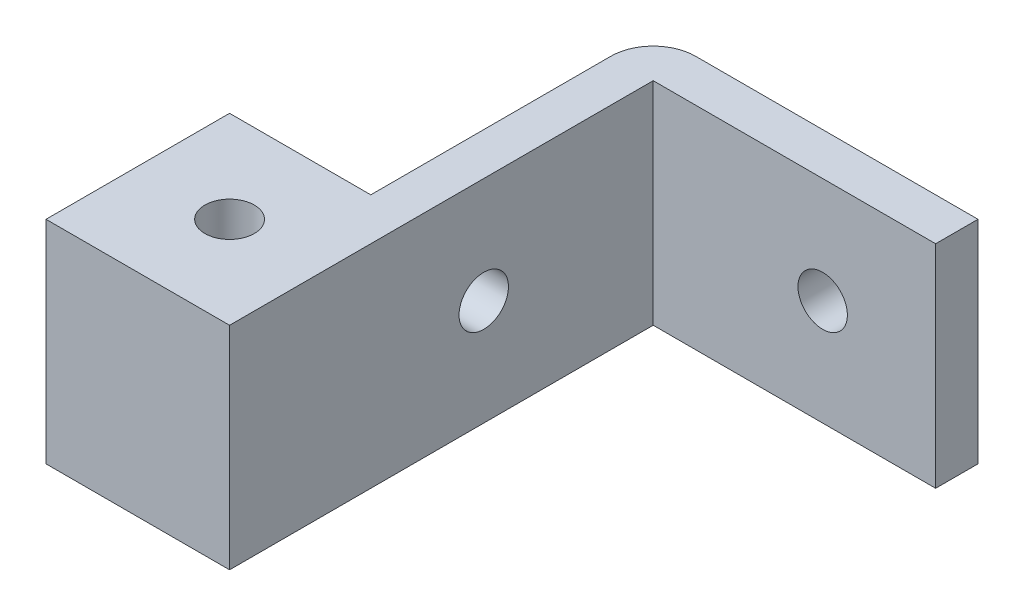
ISO-10303-21;
HEADER;
FILE_DESCRIPTION(('STEP AP214'),'2;1');
FILE_NAME('part.step','',(''),(''),'','','');
FILE_SCHEMA(('AUTOMOTIVE_DESIGN { 1 0 10303 214 1 1 1 1 }'));
ENDSEC;
DATA;
#1=APPLICATION_CONTEXT('core data for automotive mechanical design processes');
#2=APPLICATION_PROTOCOL_DEFINITION('international standard','automotive_design',2000,#1);
#3=PRODUCT_CONTEXT('',#1,'mechanical');
#4=PRODUCT('Part','Part','',(#3));
#5=PRODUCT_RELATED_PRODUCT_CATEGORY('part','',(#4));
#6=PRODUCT_DEFINITION_FORMATION('','',#4);
#7=PRODUCT_DEFINITION_CONTEXT('part definition',#1,'design');
#8=PRODUCT_DEFINITION('design','',#6,#7);
#9=PRODUCT_DEFINITION_SHAPE('','',#8);
#10=(LENGTH_UNIT() NAMED_UNIT(*) SI_UNIT(.MILLI.,.METRE.));
#11=(NAMED_UNIT(*) PLANE_ANGLE_UNIT() SI_UNIT($,.RADIAN.));
#12=(NAMED_UNIT(*) SI_UNIT($,.STERADIAN.) SOLID_ANGLE_UNIT());
#13=UNCERTAINTY_MEASURE_WITH_UNIT(LENGTH_MEASURE(1.E-05),#10,'distance_accuracy_value','');
#14=(GEOMETRIC_REPRESENTATION_CONTEXT(3) GLOBAL_UNCERTAINTY_ASSIGNED_CONTEXT((#13)) GLOBAL_UNIT_ASSIGNED_CONTEXT((#10,
#11,#12)) REPRESENTATION_CONTEXT('',''));
#15=CARTESIAN_POINT('',(0.,0.,0.));
#16=DIRECTION('',(0.,0.,1.));
#17=DIRECTION('',(1.,0.,0.));
#18=AXIS2_PLACEMENT_3D('',#15,#16,#17);
#19=CARTESIAN_POINT('',(-11.5,-7.5,3.));
#20=DIRECTION('',(1.,0.,0.));
#21=DIRECTION('',(0.,0.,-1.));
#22=AXIS2_PLACEMENT_3D('',#19,#20,#21);
#23=PLANE('',#22);
#24=CARTESIAN_POINT('',(-11.5,0.,15.));
#25=DIRECTION('',(-1.,0.,0.));
#26=DIRECTION('',(0.,0.,1.));
#27=AXIS2_PLACEMENT_3D('',#24,#25,#26);
#28=CIRCLE('',#27,1.75);
#29=CARTESIAN_POINT('',(-11.5,0.,16.75));
#30=VERTEX_POINT('',#29);
#31=EDGE_CURVE('E130',#30,#30,#28,.T.);
#32=ORIENTED_EDGE('',*,*,#31,.F.);
#33=EDGE_LOOP('',(#32));
#34=FACE_BOUND('',#33,.T.);
#35=DIRECTION('',(0.,-1.,0.));
#36=VECTOR('',#35,1.);
#37=CARTESIAN_POINT('',(-11.5,-7.5,20.));
#38=LINE('',#37,#36);
#39=CARTESIAN_POINT('',(-11.5,7.5,20.));
#40=VERTEX_POINT('',#39);
#41=CARTESIAN_POINT('',(-11.5,-7.5,20.));
#42=VERTEX_POINT('',#41);
#43=EDGE_CURVE('E145',#40,#42,#38,.T.);
#44=ORIENTED_EDGE('',*,*,#43,.F.);
#45=DIRECTION('',(0.,0.,-1.));
#46=VECTOR('',#45,1.);
#47=CARTESIAN_POINT('',(-11.5,7.5,3.));
#48=LINE('',#47,#46);
#49=CARTESIAN_POINT('',(-11.5,7.5,3.));
#50=VERTEX_POINT('',#49);
#51=EDGE_CURVE('E198',#40,#50,#48,.T.);
#52=ORIENTED_EDGE('',*,*,#51,.T.);
#53=DIRECTION('',(0.,-1.,0.));
#54=VECTOR('',#53,1.);
#55=CARTESIAN_POINT('',(-11.5,-7.5,3.));
#56=LINE('',#55,#54);
#57=CARTESIAN_POINT('',(-11.5,-7.5,3.));
#58=VERTEX_POINT('',#57);
#59=EDGE_CURVE('E203',#50,#58,#56,.T.);
#60=ORIENTED_EDGE('',*,*,#59,.T.);
#61=DIRECTION('',(0.,0.,-1.));
#62=VECTOR('',#61,1.);
#63=CARTESIAN_POINT('',(-11.5,-7.5,3.));
#64=LINE('',#63,#62);
#65=EDGE_CURVE('E196',#42,#58,#64,.T.);
#66=ORIENTED_EDGE('',*,*,#65,.F.);
#67=EDGE_LOOP('',(#44,#52,#60,#66));
#68=FACE_BOUND('',#67,.T.);
#69=ADVANCED_FACE('F49',(#34,#68),#23,.F.);
#70=CARTESIAN_POINT('',(0.,0.,3.));
#71=DIRECTION('',(0.,0.,-1.));
#72=DIRECTION('',(-1.,0.,0.));
#73=AXIS2_PLACEMENT_3D('',#70,#71,#72);
#74=PLANE('',#73);
#75=CARTESIAN_POINT('',(3.5,0.,3.));
#76=DIRECTION('',(0.,0.,-1.));
#77=DIRECTION('',(-1.,0.,0.));
#78=AXIS2_PLACEMENT_3D('',#75,#76,#77);
#79=CIRCLE('',#78,1.75);
#80=CARTESIAN_POINT('',(1.75,0.,3.));
#81=VERTEX_POINT('',#80);
#82=EDGE_CURVE('E168',#81,#81,#79,.T.);
#83=ORIENTED_EDGE('',*,*,#82,.T.);
#84=EDGE_LOOP('',(#83));
#85=FACE_BOUND('',#84,.T.);
#86=DIRECTION('',(0.,1.,0.));
#87=VECTOR('',#86,1.);
#88=CARTESIAN_POINT('',(-8.5,7.5,3.));
#89=LINE('',#88,#87);
#90=CARTESIAN_POINT('',(-8.5,-7.5,3.));
#91=VERTEX_POINT('',#90);
#92=CARTESIAN_POINT('',(-8.5,7.5,3.));
#93=VERTEX_POINT('',#92);
#94=EDGE_CURVE('E171',#91,#93,#89,.T.);
#95=ORIENTED_EDGE('',*,*,#94,.F.);
#96=DIRECTION('',(1.,0.,0.));
#97=VECTOR('',#96,1.);
#98=CARTESIAN_POINT('',(-11.5,-7.5,3.));
#99=LINE('',#98,#97);
#100=CARTESIAN_POINT('',(11.5,-7.5,3.));
#101=VERTEX_POINT('',#100);
#102=EDGE_CURVE('E186',#91,#101,#99,.T.);
#103=ORIENTED_EDGE('',*,*,#102,.T.);
#104=DIRECTION('',(0.,1.,0.));
#105=VECTOR('',#104,1.);
#106=CARTESIAN_POINT('',(11.5,-7.5,3.));
#107=LINE('',#106,#105);
#108=CARTESIAN_POINT('',(11.5,7.5,3.));
#109=VERTEX_POINT('',#108);
#110=EDGE_CURVE('E180',#101,#109,#107,.T.);
#111=ORIENTED_EDGE('',*,*,#110,.T.);
#112=DIRECTION('',(-1.,0.,0.));
#113=VECTOR('',#112,1.);
#114=CARTESIAN_POINT('',(-11.5,7.5,3.));
#115=LINE('',#114,#113);
#116=EDGE_CURVE('E183',#109,#93,#115,.T.);
#117=ORIENTED_EDGE('',*,*,#116,.T.);
#118=EDGE_LOOP('',(#95,#103,#111,#117));
#119=FACE_BOUND('',#118,.T.);
#120=ADVANCED_FACE('F226',(#85,#119),#74,.F.);
#121=CARTESIAN_POINT('',(11.5,-7.5,3.));
#122=DIRECTION('',(-1.,0.,0.));
#123=DIRECTION('',(0.,0.,1.));
#124=AXIS2_PLACEMENT_3D('',#121,#122,#123);
#125=PLANE('',#124);
#126=DIRECTION('',(0.,1.,0.));
#127=VECTOR('',#126,1.);
#128=CARTESIAN_POINT('',(11.5,-7.5,0.));
#129=LINE('',#128,#127);
#130=CARTESIAN_POINT('',(11.5,-7.5,0.));
#131=VERTEX_POINT('',#130);
#132=CARTESIAN_POINT('',(11.5,7.5,0.));
#133=VERTEX_POINT('',#132);
#134=EDGE_CURVE('E179',#131,#133,#129,.T.);
#135=ORIENTED_EDGE('',*,*,#134,.T.);
#136=DIRECTION('',(0.,0.,-1.));
#137=VECTOR('',#136,1.);
#138=CARTESIAN_POINT('',(11.5,7.5,3.));
#139=LINE('',#138,#137);
#140=EDGE_CURVE('E200',#109,#133,#139,.T.);
#141=ORIENTED_EDGE('',*,*,#140,.F.);
#142=ORIENTED_EDGE('',*,*,#110,.F.);
#143=DIRECTION('',(0.,0.,-1.));
#144=VECTOR('',#143,1.);
#145=CARTESIAN_POINT('',(11.5,-7.5,3.));
#146=LINE('',#145,#144);
#147=EDGE_CURVE('E188',#101,#131,#146,.T.);
#148=ORIENTED_EDGE('',*,*,#147,.T.);
#149=EDGE_LOOP('',(#135,#141,#142,#148));
#150=FACE_BOUND('',#149,.T.);
#151=ADVANCED_FACE('F218',(#150),#125,.F.);
#152=CARTESIAN_POINT('',(-11.5,7.5,3.));
#153=DIRECTION('',(0.,-1.,0.));
#154=DIRECTION('',(0.,0.,-1.));
#155=AXIS2_PLACEMENT_3D('',#152,#153,#154);
#156=PLANE('',#155);
#157=CARTESIAN_POINT('',(-15.,7.5,26.5));
#158=DIRECTION('',(0.,-1.,0.));
#159=DIRECTION('',(0.,0.,-1.));
#160=AXIS2_PLACEMENT_3D('',#157,#158,#159);
#161=CIRCLE('',#160,1.75);
#162=CARTESIAN_POINT('',(-15.,7.5,24.75));
#163=VERTEX_POINT('',#162);
#164=EDGE_CURVE('E147',#163,#163,#161,.T.);
#165=ORIENTED_EDGE('',*,*,#164,.T.);
#166=EDGE_LOOP('',(#165));
#167=FACE_BOUND('',#166,.T.);
#168=DIRECTION('',(-1.,0.,0.));
#169=VECTOR('',#168,1.);
#170=CARTESIAN_POINT('',(-11.5,7.5,0.));
#171=LINE('',#170,#169);
#172=CARTESIAN_POINT('',(-8.5,7.5,0.));
#173=VERTEX_POINT('',#172);
#174=EDGE_CURVE('E191',#133,#173,#171,.T.);
#175=ORIENTED_EDGE('',*,*,#174,.T.);
#176=CARTESIAN_POINT('',(-8.5,7.5,3.));
#177=DIRECTION('',(0.,-1.,0.));
#178=DIRECTION('',(0.,0.,-1.));
#179=AXIS2_PLACEMENT_3D('',#176,#177,#178);
#180=CIRCLE('',#179,3.);
#181=EDGE_CURVE('E13',#173,#50,#180,.F.);
#182=ORIENTED_EDGE('',*,*,#181,.T.);
#183=ORIENTED_EDGE('',*,*,#51,.F.);
#184=DIRECTION('',(1.,0.,0.));
#185=VECTOR('',#184,1.);
#186=CARTESIAN_POINT('',(-21.5,7.5,20.));
#187=LINE('',#186,#185);
#188=CARTESIAN_POINT('',(-21.5,7.5,20.));
#189=VERTEX_POINT('',#188);
#190=EDGE_CURVE('E136',#189,#40,#187,.T.);
#191=ORIENTED_EDGE('',*,*,#190,.F.);
#192=DIRECTION('',(0.,0.,-1.));
#193=VECTOR('',#192,1.);
#194=CARTESIAN_POINT('',(-21.5,7.5,33.));
#195=LINE('',#194,#193);
#196=CARTESIAN_POINT('',(-21.5,7.5,33.));
#197=VERTEX_POINT('',#196);
#198=EDGE_CURVE('E133',#197,#189,#195,.T.);
#199=ORIENTED_EDGE('',*,*,#198,.F.);
#200=DIRECTION('',(-1.,0.,0.));
#201=VECTOR('',#200,1.);
#202=CARTESIAN_POINT('',(-11.5,7.5,33.));
#203=LINE('',#202,#201);
#204=CARTESIAN_POINT('',(-8.5,7.5,33.));
#205=VERTEX_POINT('',#204);
#206=EDGE_CURVE('E120',#205,#197,#203,.T.);
#207=ORIENTED_EDGE('',*,*,#206,.F.);
#208=DIRECTION('',(0.,0.,-1.));
#209=VECTOR('',#208,1.);
#210=CARTESIAN_POINT('',(-8.5,7.5,23.));
#211=LINE('',#210,#209);
#212=EDGE_CURVE('E174',#205,#93,#211,.T.);
#213=ORIENTED_EDGE('',*,*,#212,.T.);
#214=ORIENTED_EDGE('',*,*,#116,.F.);
#215=ORIENTED_EDGE('',*,*,#140,.T.);
#216=EDGE_LOOP('',(#175,#182,#183,#191,#199,#207,#213,#214,#215));
#217=FACE_BOUND('',#216,.T.);
#218=ADVANCED_FACE('F134',(#167,#217),#156,.F.);
#219=CARTESIAN_POINT('',(-11.5,-7.5,3.));
#220=DIRECTION('',(0.,1.,0.));
#221=DIRECTION('',(0.,0.,1.));
#222=AXIS2_PLACEMENT_3D('',#219,#220,#221);
#223=PLANE('',#222);
#224=CARTESIAN_POINT('',(-15.,-7.5,26.5));
#225=DIRECTION('',(0.,-1.,0.));
#226=DIRECTION('',(0.,0.,-1.));
#227=AXIS2_PLACEMENT_3D('',#224,#225,#226);
#228=CIRCLE('',#227,1.75);
#229=CARTESIAN_POINT('',(-15.,-7.5,24.75));
#230=VERTEX_POINT('',#229);
#231=EDGE_CURVE('E150',#230,#230,#228,.T.);
#232=ORIENTED_EDGE('',*,*,#231,.F.);
#233=EDGE_LOOP('',(#232));
#234=FACE_BOUND('',#233,.T.);
#235=DIRECTION('',(1.,0.,0.));
#236=VECTOR('',#235,1.);
#237=CARTESIAN_POINT('',(-11.5,-7.5,33.));
#238=LINE('',#237,#236);
#239=CARTESIAN_POINT('',(-21.5,-7.5,33.));
#240=VERTEX_POINT('',#239);
#241=CARTESIAN_POINT('',(-8.5,-7.5,33.));
#242=VERTEX_POINT('',#241);
#243=EDGE_CURVE('E159',#240,#242,#238,.T.);
#244=ORIENTED_EDGE('',*,*,#243,.F.);
#245=DIRECTION('',(0.,0.,1.));
#246=VECTOR('',#245,1.);
#247=CARTESIAN_POINT('',(-21.5,-7.5,33.));
#248=LINE('',#247,#246);
#249=CARTESIAN_POINT('',(-21.5,-7.5,20.));
#250=VERTEX_POINT('',#249);
#251=EDGE_CURVE('E144',#250,#240,#248,.T.);
#252=ORIENTED_EDGE('',*,*,#251,.F.);
#253=DIRECTION('',(1.,0.,0.));
#254=VECTOR('',#253,1.);
#255=CARTESIAN_POINT('',(-21.5,-7.5,20.));
#256=LINE('',#255,#254);
#257=EDGE_CURVE('E154',#250,#42,#256,.T.);
#258=ORIENTED_EDGE('',*,*,#257,.T.);
#259=ORIENTED_EDGE('',*,*,#65,.T.);
#260=CARTESIAN_POINT('',(-8.5,-7.5,3.));
#261=DIRECTION('',(0.,1.,0.));
#262=DIRECTION('',(0.,0.,1.));
#263=AXIS2_PLACEMENT_3D('',#260,#261,#262);
#264=CIRCLE('',#263,3.);
#265=CARTESIAN_POINT('',(-8.5,-7.5,0.));
#266=VERTEX_POINT('',#265);
#267=EDGE_CURVE('E71',#58,#266,#264,.F.);
#268=ORIENTED_EDGE('',*,*,#267,.T.);
#269=DIRECTION('',(1.,0.,0.));
#270=VECTOR('',#269,1.);
#271=CARTESIAN_POINT('',(-11.5,-7.5,0.));
#272=LINE('',#271,#270);
#273=EDGE_CURVE('E184',#266,#131,#272,.T.);
#274=ORIENTED_EDGE('',*,*,#273,.T.);
#275=ORIENTED_EDGE('',*,*,#147,.F.);
#276=ORIENTED_EDGE('',*,*,#102,.F.);
#277=DIRECTION('',(0.,0.,-1.));
#278=VECTOR('',#277,1.);
#279=CARTESIAN_POINT('',(-8.5,-7.5,23.));
#280=LINE('',#279,#278);
#281=EDGE_CURVE('E176',#242,#91,#280,.T.);
#282=ORIENTED_EDGE('',*,*,#281,.F.);
#283=EDGE_LOOP('',(#244,#252,#258,#259,#268,#274,#275,#276,#282));
#284=FACE_BOUND('',#283,.T.);
#285=ADVANCED_FACE('F222',(#234,#284),#223,.F.);
#286=CARTESIAN_POINT('',(0.,0.,0.));
#287=DIRECTION('',(0.,0.,-1.));
#288=DIRECTION('',(-1.,0.,0.));
#289=AXIS2_PLACEMENT_3D('',#286,#287,#288);
#290=PLANE('',#289);
#291=CARTESIAN_POINT('',(3.5,0.,0.));
#292=DIRECTION('',(0.,0.,-1.));
#293=DIRECTION('',(-1.,0.,0.));
#294=AXIS2_PLACEMENT_3D('',#291,#292,#293);
#295=CIRCLE('',#294,1.75);
#296=CARTESIAN_POINT('',(1.75,0.,0.));
#297=VERTEX_POINT('',#296);
#298=EDGE_CURVE('E165',#297,#297,#295,.T.);
#299=ORIENTED_EDGE('',*,*,#298,.F.);
#300=EDGE_LOOP('',(#299));
#301=FACE_BOUND('',#300,.T.);
#302=ORIENTED_EDGE('',*,*,#273,.F.);
#303=DIRECTION('',(0.,-1.,0.));
#304=VECTOR('',#303,1.);
#305=CARTESIAN_POINT('',(-8.5,7.5,0.));
#306=LINE('',#305,#304);
#307=EDGE_CURVE('E57',#266,#173,#306,.F.);
#308=ORIENTED_EDGE('',*,*,#307,.T.);
#309=ORIENTED_EDGE('',*,*,#174,.F.);
#310=ORIENTED_EDGE('',*,*,#134,.F.);
#311=EDGE_LOOP('',(#302,#308,#309,#310));
#312=FACE_BOUND('',#311,.T.);
#313=ADVANCED_FACE('F216',(#301,#312),#290,.T.);
#314=CARTESIAN_POINT('',(-8.5,7.5,23.));
#315=DIRECTION('',(-1.,0.,0.));
#316=DIRECTION('',(0.,0.,1.));
#317=AXIS2_PLACEMENT_3D('',#314,#315,#316);
#318=PLANE('',#317);
#319=CARTESIAN_POINT('',(-8.5,0.,15.));
#320=DIRECTION('',(-1.,0.,0.));
#321=DIRECTION('',(0.,0.,1.));
#322=AXIS2_PLACEMENT_3D('',#319,#320,#321);
#323=CIRCLE('',#322,1.75);
#324=CARTESIAN_POINT('',(-8.5,0.,16.75));
#325=VERTEX_POINT('',#324);
#326=EDGE_CURVE('E164',#325,#325,#323,.T.);
#327=ORIENTED_EDGE('',*,*,#326,.T.);
#328=EDGE_LOOP('',(#327));
#329=FACE_BOUND('',#328,.T.);
#330=ORIENTED_EDGE('',*,*,#94,.T.);
#331=ORIENTED_EDGE('',*,*,#212,.F.);
#332=DIRECTION('',(0.,1.,0.));
#333=VECTOR('',#332,1.);
#334=CARTESIAN_POINT('',(-8.5,-7.5,33.));
#335=LINE('',#334,#333);
#336=EDGE_CURVE('E127',#242,#205,#335,.T.);
#337=ORIENTED_EDGE('',*,*,#336,.F.);
#338=ORIENTED_EDGE('',*,*,#281,.T.);
#339=EDGE_LOOP('',(#330,#331,#337,#338));
#340=FACE_BOUND('',#339,.T.);
#341=ADVANCED_FACE('F225',(#329,#340),#318,.F.);
#342=CARTESIAN_POINT('',(3.5,0.,23.));
#343=DIRECTION('',(0.,0.,-1.));
#344=DIRECTION('',(-1.,0.,0.));
#345=AXIS2_PLACEMENT_3D('',#342,#343,#344);
#346=CYLINDRICAL_SURFACE('',#345,1.75);
#347=ORIENTED_EDGE('',*,*,#298,.T.);
#348=EDGE_LOOP('',(#347));
#349=FACE_BOUND('',#348,.T.);
#350=ORIENTED_EDGE('',*,*,#82,.F.);
#351=EDGE_LOOP('',(#350));
#352=FACE_BOUND('',#351,.T.);
#353=ADVANCED_FACE('F271',(#349,#352),#346,.F.);
#354=CARTESIAN_POINT('',(11.5,0.,15.));
#355=DIRECTION('',(-1.,0.,0.));
#356=DIRECTION('',(0.,0.,1.));
#357=AXIS2_PLACEMENT_3D('',#354,#355,#356);
#358=CYLINDRICAL_SURFACE('',#357,1.75);
#359=ORIENTED_EDGE('',*,*,#31,.T.);
#360=EDGE_LOOP('',(#359));
#361=FACE_BOUND('',#360,.T.);
#362=ORIENTED_EDGE('',*,*,#326,.F.);
#363=EDGE_LOOP('',(#362));
#364=FACE_BOUND('',#363,.T.);
#365=ADVANCED_FACE('F269',(#361,#364),#358,.F.);
#366=CARTESIAN_POINT('',(-8.5,-7.5,3.));
#367=DIRECTION('',(0.,1.,0.));
#368=DIRECTION('',(0.,0.,1.));
#369=AXIS2_PLACEMENT_3D('',#366,#367,#368);
#370=CYLINDRICAL_SURFACE('',#369,3.);
#371=ORIENTED_EDGE('',*,*,#181,.F.);
#372=ORIENTED_EDGE('',*,*,#307,.F.);
#373=ORIENTED_EDGE('',*,*,#267,.F.);
#374=ORIENTED_EDGE('',*,*,#59,.F.);
#375=EDGE_LOOP('',(#371,#372,#373,#374));
#376=FACE_BOUND('',#375,.T.);
#377=ADVANCED_FACE('F51',(#376),#370,.T.);
#378=CARTESIAN_POINT('',(0.,0.,33.));
#379=DIRECTION('',(0.,0.,-1.));
#380=DIRECTION('',(-1.,0.,0.));
#381=AXIS2_PLACEMENT_3D('',#378,#379,#380);
#382=PLANE('',#381);
#383=ORIENTED_EDGE('',*,*,#206,.T.);
#384=DIRECTION('',(0.,1.,0.));
#385=VECTOR('',#384,1.);
#386=CARTESIAN_POINT('',(-21.5,-7.5,33.));
#387=LINE('',#386,#385);
#388=EDGE_CURVE('E125',#240,#197,#387,.T.);
#389=ORIENTED_EDGE('',*,*,#388,.F.);
#390=ORIENTED_EDGE('',*,*,#243,.T.);
#391=ORIENTED_EDGE('',*,*,#336,.T.);
#392=EDGE_LOOP('',(#383,#389,#390,#391));
#393=FACE_BOUND('',#392,.T.);
#394=ADVANCED_FACE('F122',(#393),#382,.F.);
#395=CARTESIAN_POINT('',(-21.5,-7.5,20.));
#396=DIRECTION('',(0.,0.,1.));
#397=DIRECTION('',(1.,0.,0.));
#398=AXIS2_PLACEMENT_3D('',#395,#396,#397);
#399=PLANE('',#398);
#400=ORIENTED_EDGE('',*,*,#43,.T.);
#401=ORIENTED_EDGE('',*,*,#257,.F.);
#402=DIRECTION('',(0.,-1.,0.));
#403=VECTOR('',#402,1.);
#404=CARTESIAN_POINT('',(-21.5,-7.5,20.));
#405=LINE('',#404,#403);
#406=EDGE_CURVE('E139',#189,#250,#405,.T.);
#407=ORIENTED_EDGE('',*,*,#406,.F.);
#408=ORIENTED_EDGE('',*,*,#190,.T.);
#409=EDGE_LOOP('',(#400,#401,#407,#408));
#410=FACE_BOUND('',#409,.T.);
#411=ADVANCED_FACE('F261',(#410),#399,.F.);
#412=CARTESIAN_POINT('',(-21.5,0.,0.));
#413=DIRECTION('',(-1.,0.,0.));
#414=DIRECTION('',(0.,0.,1.));
#415=AXIS2_PLACEMENT_3D('',#412,#413,#414);
#416=PLANE('',#415);
#417=ORIENTED_EDGE('',*,*,#388,.T.);
#418=ORIENTED_EDGE('',*,*,#198,.T.);
#419=ORIENTED_EDGE('',*,*,#406,.T.);
#420=ORIENTED_EDGE('',*,*,#251,.T.);
#421=EDGE_LOOP('',(#417,#418,#419,#420));
#422=FACE_BOUND('',#421,.T.);
#423=ADVANCED_FACE('F142',(#422),#416,.T.);
#424=CARTESIAN_POINT('',(-15.,7.5,26.5));
#425=DIRECTION('',(0.,-1.,0.));
#426=DIRECTION('',(0.,0.,-1.));
#427=AXIS2_PLACEMENT_3D('',#424,#425,#426);
#428=CYLINDRICAL_SURFACE('',#427,1.75);
#429=ORIENTED_EDGE('',*,*,#164,.F.);
#430=EDGE_LOOP('',(#429));
#431=FACE_BOUND('',#430,.T.);
#432=ORIENTED_EDGE('',*,*,#231,.T.);
#433=EDGE_LOOP('',(#432));
#434=FACE_BOUND('',#433,.T.);
#435=ADVANCED_FACE('F255',(#431,#434),#428,.F.);
#436=CLOSED_SHELL('',(#69,#120,#151,#218,#285,#313,#341,#353,#365,#377,#394,#411,#423,#435));
#437=MANIFOLD_SOLID_BREP('B2',#436);
#438=ADVANCED_BREP_SHAPE_REPRESENTATION('',(#18,#437),#14);
#439=SHAPE_DEFINITION_REPRESENTATION(#9,#438);
ENDSEC;
END-ISO-10303-21;
